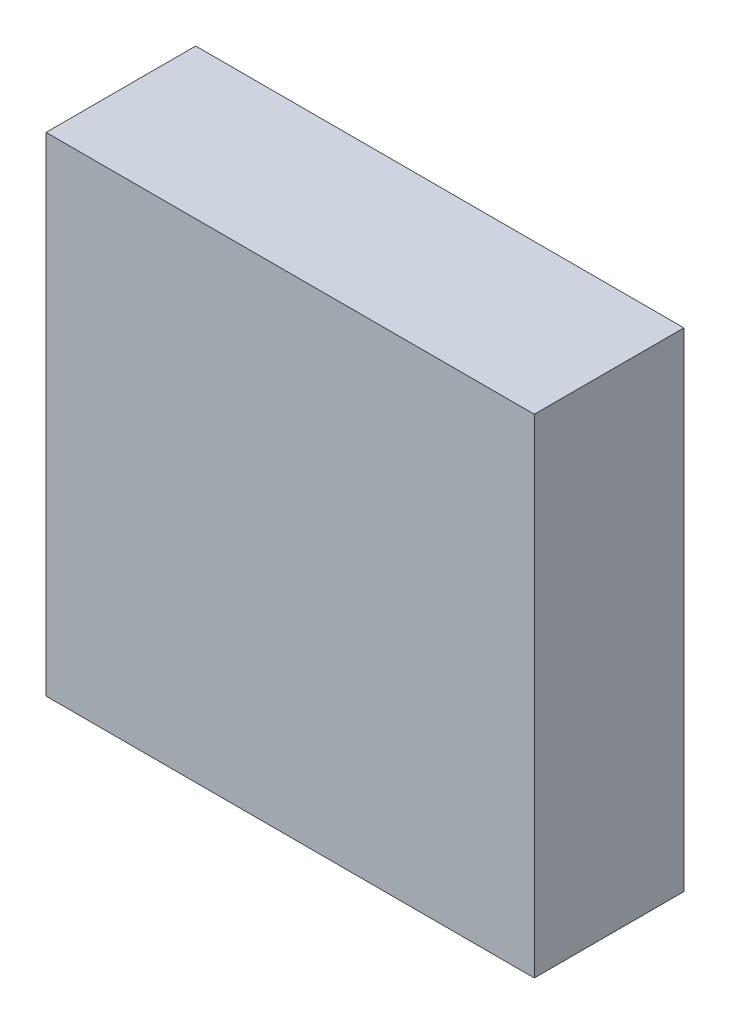
ISO-10303-21;
HEADER;
FILE_DESCRIPTION(('STEP AP214'),'2;1');
FILE_NAME('part.step','',(''),(''),'','','');
FILE_SCHEMA(('AUTOMOTIVE_DESIGN { 1 0 10303 214 1 1 1 1 }'));
ENDSEC;
DATA;
#1=APPLICATION_CONTEXT('core data for automotive mechanical design processes');
#2=APPLICATION_PROTOCOL_DEFINITION('international standard','automotive_design',2000,#1);
#3=PRODUCT_CONTEXT('',#1,'mechanical');
#4=PRODUCT('Part','Part','',(#3));
#5=PRODUCT_RELATED_PRODUCT_CATEGORY('part','',(#4));
#6=PRODUCT_DEFINITION_FORMATION('','',#4);
#7=PRODUCT_DEFINITION_CONTEXT('part definition',#1,'design');
#8=PRODUCT_DEFINITION('design','',#6,#7);
#9=PRODUCT_DEFINITION_SHAPE('','',#8);
#10=(LENGTH_UNIT() NAMED_UNIT(*) SI_UNIT(.MILLI.,.METRE.));
#11=(NAMED_UNIT(*) PLANE_ANGLE_UNIT() SI_UNIT($,.RADIAN.));
#12=(NAMED_UNIT(*) SI_UNIT($,.STERADIAN.) SOLID_ANGLE_UNIT());
#13=UNCERTAINTY_MEASURE_WITH_UNIT(LENGTH_MEASURE(1.E-05),#10,'distance_accuracy_value','');
#14=(GEOMETRIC_REPRESENTATION_CONTEXT(3) GLOBAL_UNCERTAINTY_ASSIGNED_CONTEXT((#13)) GLOBAL_UNIT_ASSIGNED_CONTEXT((#10,
#11,#12)) REPRESENTATION_CONTEXT('',''));
#15=CARTESIAN_POINT('',(0.,0.,0.));
#16=DIRECTION('',(0.,0.,1.));
#17=DIRECTION('',(1.,0.,0.));
#18=AXIS2_PLACEMENT_3D('',#15,#16,#17);
#19=CARTESIAN_POINT('',(1.54999944,-1.54999944,0.95000064));
#20=DIRECTION('',(0.,0.,1.));
#21=DIRECTION('',(1.,0.,0.));
#22=AXIS2_PLACEMENT_3D('',#19,#20,#21);
#23=PLANE('',#22);
#24=DIRECTION('',(8.19354471591425E-07,-0.999999999999664,0.));
#25=VECTOR('',#24,1.);
#26=CARTESIAN_POINT('',(-1.54999944,-1.54999944,0.95000064));
#27=LINE('',#26,#25);
#28=CARTESIAN_POINT('',(-1.55000071,-1.54999944,0.95000064));
#29=VERTEX_POINT('',#28);
#30=CARTESIAN_POINT('',(-1.55000198000001,1.55000198,0.95000064));
#31=VERTEX_POINT('',#30);
#32=EDGE_CURVE('E52',#29,#31,#27,.F.);
#33=ORIENTED_EDGE('',*,*,#32,.F.);
#34=DIRECTION('',(1.,0.,0.));
#35=VECTOR('',#34,1.);
#36=CARTESIAN_POINT('',(1.54999944,-1.54999944,0.95000064));
#37=LINE('',#36,#35);
#38=CARTESIAN_POINT('',(1.54999944,-1.54999944,0.95000064));
#39=VERTEX_POINT('',#38);
#40=EDGE_CURVE('E67',#39,#29,#37,.F.);
#41=ORIENTED_EDGE('',*,*,#40,.F.);
#42=DIRECTION('',(8.19354462423125E-07,0.999999999999664,0.));
#43=VECTOR('',#42,1.);
#44=CARTESIAN_POINT('',(1.55000198,1.55000198,0.95000064));
#45=LINE('',#44,#43);
#46=CARTESIAN_POINT('',(1.55000071,1.55000198,0.95000064));
#47=VERTEX_POINT('',#46);
#48=EDGE_CURVE('E19',#47,#39,#45,.F.);
#49=ORIENTED_EDGE('',*,*,#48,.F.);
#50=DIRECTION('',(1.,0.,0.));
#51=VECTOR('',#50,1.);
#52=CARTESIAN_POINT('',(-1.55000198,1.55000198,0.95000064));
#53=LINE('',#52,#51);
#54=EDGE_CURVE('E57',#31,#47,#53,.T.);
#55=ORIENTED_EDGE('',*,*,#54,.F.);
#56=EDGE_LOOP('',(#33,#41,#49,#55));
#57=FACE_BOUND('',#56,.T.);
#58=ADVANCED_FACE('F16',(#57),#23,.T.);
#59=CARTESIAN_POINT('',(1.55000198,1.55000198,0.));
#60=DIRECTION('',(0.999999999999664,-8.19354462423125E-07,0.));
#61=DIRECTION('',(8.19354462423125E-07,0.999999999999664,0.));
#62=AXIS2_PLACEMENT_3D('',#59,#60,#61);
#63=PLANE('',#62);
#64=DIRECTION('',(0.,0.,-1.));
#65=VECTOR('',#64,1.);
#66=CARTESIAN_POINT('',(1.54999944,-1.54999944,0.));
#67=LINE('',#66,#65);
#68=CARTESIAN_POINT('',(1.54999944,-1.54999944,0.));
#69=VERTEX_POINT('',#68);
#70=EDGE_CURVE('E78',#69,#39,#67,.F.);
#71=ORIENTED_EDGE('',*,*,#70,.F.);
#72=DIRECTION('',(0.,1.,0.));
#73=VECTOR('',#72,1.);
#74=CARTESIAN_POINT('',(1.54999944,-1.54999944,0.));
#75=LINE('',#74,#73);
#76=CARTESIAN_POINT('',(1.550001345,1.55000198,0.));
#77=VERTEX_POINT('',#76);
#78=EDGE_CURVE('E73',#69,#77,#75,.T.);
#79=ORIENTED_EDGE('',*,*,#78,.T.);
#80=DIRECTION('',(0.,0.,1.));
#81=VECTOR('',#80,1.);
#82=CARTESIAN_POINT('',(1.55000198,1.55000198,0.));
#83=LINE('',#82,#81);
#84=EDGE_CURVE('E62',#47,#77,#83,.F.);
#85=ORIENTED_EDGE('',*,*,#84,.F.);
#86=ORIENTED_EDGE('',*,*,#48,.T.);
#87=EDGE_LOOP('',(#71,#79,#85,#86));
#88=FACE_BOUND('',#87,.T.);
#89=ADVANCED_FACE('F72',(#88),#63,.T.);
#90=CARTESIAN_POINT('',(-1.55000198,1.55000198,0.));
#91=DIRECTION('',(0.,1.,0.));
#92=DIRECTION('',(0.,0.,1.));
#93=AXIS2_PLACEMENT_3D('',#90,#91,#92);
#94=PLANE('',#93);
#95=ORIENTED_EDGE('',*,*,#84,.T.);
#96=DIRECTION('',(1.,0.,0.));
#97=VECTOR('',#96,1.);
#98=CARTESIAN_POINT('',(1.54999944,1.55000198,0.));
#99=LINE('',#98,#97);
#100=CARTESIAN_POINT('',(-1.55000198000001,1.55000198,0.));
#101=VERTEX_POINT('',#100);
#102=EDGE_CURVE('E83',#77,#101,#99,.F.);
#103=ORIENTED_EDGE('',*,*,#102,.T.);
#104=DIRECTION('',(0.,0.,1.));
#105=VECTOR('',#104,1.);
#106=CARTESIAN_POINT('',(-1.55000198000003,1.55000198,0.));
#107=LINE('',#106,#105);
#108=EDGE_CURVE('E64',#31,#101,#107,.F.);
#109=ORIENTED_EDGE('',*,*,#108,.F.);
#110=ORIENTED_EDGE('',*,*,#54,.T.);
#111=EDGE_LOOP('',(#95,#103,#109,#110));
#112=FACE_BOUND('',#111,.T.);
#113=ADVANCED_FACE('F59',(#112),#94,.T.);
#114=CARTESIAN_POINT('',(-1.54999944,-1.54999944,0.));
#115=DIRECTION('',(-0.999999999999664,-8.19354471591425E-07,0.));
#116=DIRECTION('',(8.19354471591425E-07,-0.999999999999664,0.));
#117=AXIS2_PLACEMENT_3D('',#114,#115,#116);
#118=PLANE('',#117);
#119=ORIENTED_EDGE('',*,*,#108,.T.);
#120=DIRECTION('',(0.,1.,0.));
#121=VECTOR('',#120,1.);
#122=CARTESIAN_POINT('',(-1.55000198,-1.54999944,0.));
#123=LINE('',#122,#121);
#124=CARTESIAN_POINT('',(-1.550000075,-1.54999944,0.));
#125=VERTEX_POINT('',#124);
#126=EDGE_CURVE('E25',#101,#125,#123,.F.);
#127=ORIENTED_EDGE('',*,*,#126,.T.);
#128=DIRECTION('',(0.,0.,-1.));
#129=VECTOR('',#128,1.);
#130=CARTESIAN_POINT('',(-1.54999944,-1.54999944,0.));
#131=LINE('',#130,#129);
#132=EDGE_CURVE('E33',#29,#125,#131,.T.);
#133=ORIENTED_EDGE('',*,*,#132,.F.);
#134=ORIENTED_EDGE('',*,*,#32,.T.);
#135=EDGE_LOOP('',(#119,#127,#133,#134));
#136=FACE_BOUND('',#135,.T.);
#137=ADVANCED_FACE('F87',(#136),#118,.T.);
#138=CARTESIAN_POINT('',(1.54999944,-1.54999944,0.));
#139=DIRECTION('',(0.,-1.,0.));
#140=DIRECTION('',(0.,0.,-1.));
#141=AXIS2_PLACEMENT_3D('',#138,#139,#140);
#142=PLANE('',#141);
#143=ORIENTED_EDGE('',*,*,#132,.T.);
#144=DIRECTION('',(1.,0.,0.));
#145=VECTOR('',#144,1.);
#146=CARTESIAN_POINT('',(1.54999944,-1.54999944,0.));
#147=LINE('',#146,#145);
#148=EDGE_CURVE('E11',#125,#69,#147,.T.);
#149=ORIENTED_EDGE('',*,*,#148,.T.);
#150=ORIENTED_EDGE('',*,*,#70,.T.);
#151=ORIENTED_EDGE('',*,*,#40,.T.);
#152=EDGE_LOOP('',(#143,#149,#150,#151));
#153=FACE_BOUND('',#152,.T.);
#154=ADVANCED_FACE('F90',(#153),#142,.T.);
#155=CARTESIAN_POINT('',(1.54999944,-1.54999944,0.));
#156=DIRECTION('',(0.,0.,1.));
#157=DIRECTION('',(1.,0.,0.));
#158=AXIS2_PLACEMENT_3D('',#155,#156,#157);
#159=PLANE('',#158);
#160=ORIENTED_EDGE('',*,*,#126,.F.);
#161=ORIENTED_EDGE('',*,*,#102,.F.);
#162=ORIENTED_EDGE('',*,*,#78,.F.);
#163=ORIENTED_EDGE('',*,*,#148,.F.);
#164=EDGE_LOOP('',(#160,#161,#162,#163));
#165=FACE_BOUND('',#164,.T.);
#166=ADVANCED_FACE('F89',(#165),#159,.F.);
#167=CLOSED_SHELL('',(#58,#89,#113,#137,#154,#166));
#168=MANIFOLD_SOLID_BREP('B1',#167);
#169=ADVANCED_BREP_SHAPE_REPRESENTATION('',(#18,#168),#14);
#170=SHAPE_DEFINITION_REPRESENTATION(#9,#169);
ENDSEC;
END-ISO-10303-21;
